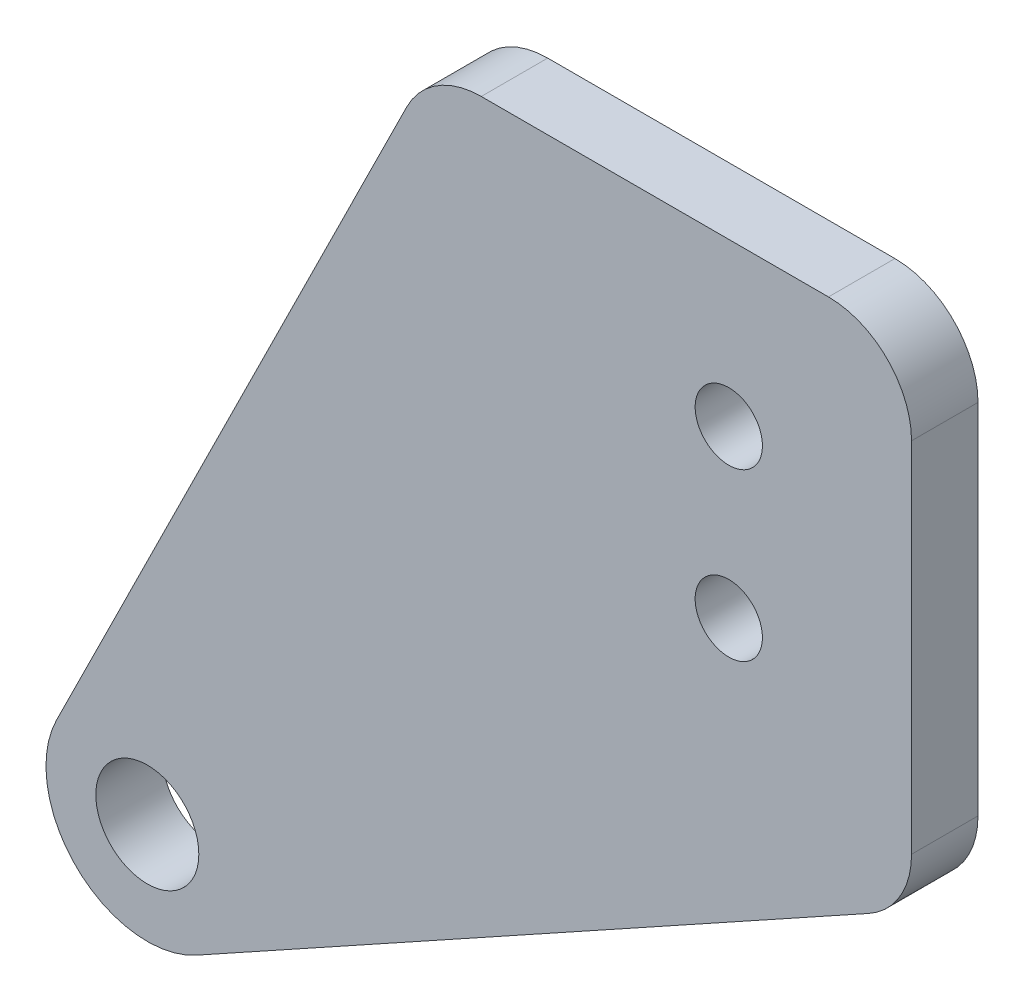
ISO-10303-21;
HEADER;
FILE_DESCRIPTION(('STEP AP214'),'2;1');
FILE_NAME('part.step','',(''),(''),'','','');
FILE_SCHEMA(('AUTOMOTIVE_DESIGN { 1 0 10303 214 1 1 1 1 }'));
ENDSEC;
DATA;
#1=APPLICATION_CONTEXT('core data for automotive mechanical design processes');
#2=APPLICATION_PROTOCOL_DEFINITION('international standard','automotive_design',2000,#1);
#3=PRODUCT_CONTEXT('',#1,'mechanical');
#4=PRODUCT('Part','Part','',(#3));
#5=PRODUCT_RELATED_PRODUCT_CATEGORY('part','',(#4));
#6=PRODUCT_DEFINITION_FORMATION('','',#4);
#7=PRODUCT_DEFINITION_CONTEXT('part definition',#1,'design');
#8=PRODUCT_DEFINITION('design','',#6,#7);
#9=PRODUCT_DEFINITION_SHAPE('','',#8);
#10=(LENGTH_UNIT() NAMED_UNIT(*) SI_UNIT(.MILLI.,.METRE.));
#11=(NAMED_UNIT(*) PLANE_ANGLE_UNIT() SI_UNIT($,.RADIAN.));
#12=(NAMED_UNIT(*) SI_UNIT($,.STERADIAN.) SOLID_ANGLE_UNIT());
#13=UNCERTAINTY_MEASURE_WITH_UNIT(LENGTH_MEASURE(1.E-05),#10,'distance_accuracy_value','');
#14=(GEOMETRIC_REPRESENTATION_CONTEXT(3) GLOBAL_UNCERTAINTY_ASSIGNED_CONTEXT((#13)) GLOBAL_UNIT_ASSIGNED_CONTEXT((#10,
#11,#12)) REPRESENTATION_CONTEXT('',''));
#15=CARTESIAN_POINT('',(0.,0.,0.));
#16=DIRECTION('',(0.,0.,1.));
#17=DIRECTION('',(1.,0.,0.));
#18=AXIS2_PLACEMENT_3D('',#15,#16,#17);
#19=CARTESIAN_POINT('',(7.89382808051515,-14.2550363224969,4.));
#20=DIRECTION('',(-0.484440231931471,0.874824360478252,0.));
#21=DIRECTION('',(-0.874824360478252,-0.484440231931471,0.));
#22=AXIS2_PLACEMENT_3D('',#19,#20,#21);
#23=PLANE('',#22);
#24=DIRECTION('',(0.874824360478252,0.484440231931471,0.));
#25=VECTOR('',#24,1.);
#26=CARTESIAN_POINT('',(7.89382808051515,-14.2550363224969,0.));
#27=LINE('',#26,#25);
#28=CARTESIAN_POINT('',(-36.044914585218,-38.5864285989173,0.));
#29=VERTEX_POINT('',#28);
#30=CARTESIAN_POINT('',(4.42220115965735,-16.1774745017452,0.));
#31=VERTEX_POINT('',#30);
#32=EDGE_CURVE('E137',#29,#31,#27,.T.);
#33=ORIENTED_EDGE('',*,*,#32,.T.);
#34=DIRECTION('',(0.,0.,-1.));
#35=VECTOR('',#34,1.);
#36=CARTESIAN_POINT('',(4.42220115965735,-16.1774745017452,4.));
#37=LINE('',#36,#35);
#38=CARTESIAN_POINT('',(4.42220115965735,-16.1774745017452,4.));
#39=VERTEX_POINT('',#38);
#40=EDGE_CURVE('E45',#31,#39,#37,.F.);
#41=ORIENTED_EDGE('',*,*,#40,.T.);
#42=DIRECTION('',(0.874824360478252,0.484440231931471,0.));
#43=VECTOR('',#42,1.);
#44=CARTESIAN_POINT('',(7.89382808051515,-14.2550363224969,4.));
#45=LINE('',#44,#43);
#46=CARTESIAN_POINT('',(-36.044914585218,-38.5864285989173,4.));
#47=VERTEX_POINT('',#46);
#48=EDGE_CURVE('E157',#47,#39,#45,.T.);
#49=ORIENTED_EDGE('',*,*,#48,.F.);
#50=DIRECTION('',(0.,0.,-1.));
#51=VECTOR('',#50,1.);
#52=CARTESIAN_POINT('',(-36.044914585218,-38.5864285989173,4.));
#53=LINE('',#52,#51);
#54=EDGE_CURVE('E121',#47,#29,#53,.T.);
#55=ORIENTED_EDGE('',*,*,#54,.T.);
#56=EDGE_LOOP('',(#33,#41,#49,#55));
#57=FACE_BOUND('',#56,.T.);
#58=ADVANCED_FACE('F37',(#57),#23,.F.);
#59=CARTESIAN_POINT('',(7.,0.,4.));
#60=DIRECTION('',(-1.,0.,0.));
#61=DIRECTION('',(0.,0.,1.));
#62=AXIS2_PLACEMENT_3D('',#59,#60,#61);
#63=PLANE('',#62);
#64=DIRECTION('',(0.,1.,0.));
#65=VECTOR('',#64,1.);
#66=CARTESIAN_POINT('',(7.,0.,0.));
#67=LINE('',#66,#65);
#68=CARTESIAN_POINT('',(7.,-11.8033526993539,0.));
#69=VERTEX_POINT('',#68);
#70=CARTESIAN_POINT('',(7.,9.75,0.));
#71=VERTEX_POINT('',#70);
#72=EDGE_CURVE('E139',#69,#71,#67,.T.);
#73=ORIENTED_EDGE('',*,*,#72,.T.);
#74=DIRECTION('',(0.,0.,-1.));
#75=VECTOR('',#74,1.);
#76=CARTESIAN_POINT('',(7.,9.75,4.));
#77=LINE('',#76,#75);
#78=CARTESIAN_POINT('',(7.,9.75,4.));
#79=VERTEX_POINT('',#78);
#80=EDGE_CURVE('E172',#71,#79,#77,.F.);
#81=ORIENTED_EDGE('',*,*,#80,.T.);
#82=DIRECTION('',(0.,1.,0.));
#83=VECTOR('',#82,1.);
#84=CARTESIAN_POINT('',(7.,0.,4.));
#85=LINE('',#84,#83);
#86=CARTESIAN_POINT('',(7.,-11.8033526993539,4.));
#87=VERTEX_POINT('',#86);
#88=EDGE_CURVE('E181',#87,#79,#85,.T.);
#89=ORIENTED_EDGE('',*,*,#88,.F.);
#90=DIRECTION('',(0.,0.,-1.));
#91=VECTOR('',#90,1.);
#92=CARTESIAN_POINT('',(7.,-11.8033526993539,4.));
#93=LINE('',#92,#91);
#94=EDGE_CURVE('E169',#87,#69,#93,.T.);
#95=ORIENTED_EDGE('',*,*,#94,.T.);
#96=EDGE_LOOP('',(#73,#81,#89,#95));
#97=FACE_BOUND('',#96,.T.);
#98=ADVANCED_FACE('F195',(#97),#63,.F.);
#99=CARTESIAN_POINT('',(0.,14.75,4.));
#100=DIRECTION('',(0.,1.,0.));
#101=DIRECTION('',(0.,0.,1.));
#102=AXIS2_PLACEMENT_3D('',#99,#100,#101);
#103=PLANE('',#102);
#104=DIRECTION('',(1.,0.,0.));
#105=VECTOR('',#104,1.);
#106=CARTESIAN_POINT('',(0.,14.75,4.));
#107=LINE('',#106,#105);
#108=CARTESIAN_POINT('',(-18.8988149973664,14.75,4.));
#109=VERTEX_POINT('',#108);
#110=CARTESIAN_POINT('',(2.,14.75,4.));
#111=VERTEX_POINT('',#110);
#112=EDGE_CURVE('E111',#109,#111,#107,.T.);
#113=ORIENTED_EDGE('',*,*,#112,.T.);
#114=DIRECTION('',(0.,0.,-1.));
#115=VECTOR('',#114,1.);
#116=CARTESIAN_POINT('',(2.,14.75,0.));
#117=LINE('',#116,#115);
#118=CARTESIAN_POINT('',(2.,14.75,0.));
#119=VERTEX_POINT('',#118);
#120=EDGE_CURVE('E160',#111,#119,#117,.T.);
#121=ORIENTED_EDGE('',*,*,#120,.T.);
#122=DIRECTION('',(1.,0.,0.));
#123=VECTOR('',#122,1.);
#124=CARTESIAN_POINT('',(0.,14.75,0.));
#125=LINE('',#124,#123);
#126=CARTESIAN_POINT('',(-18.8988149973664,14.75,0.));
#127=VERTEX_POINT('',#126);
#128=EDGE_CURVE('E142',#127,#119,#125,.T.);
#129=ORIENTED_EDGE('',*,*,#128,.F.);
#130=DIRECTION('',(0.,0.,-1.));
#131=VECTOR('',#130,1.);
#132=CARTESIAN_POINT('',(-18.8988149973664,14.75,4.));
#133=LINE('',#132,#131);
#134=EDGE_CURVE('E120',#127,#109,#133,.F.);
#135=ORIENTED_EDGE('',*,*,#134,.T.);
#136=EDGE_LOOP('',(#113,#121,#129,#135));
#137=FACE_BOUND('',#136,.T.);
#138=ADVANCED_FACE('F186',(#137),#103,.T.);
#139=CARTESIAN_POINT('',(-23.527615711847,11.6702845745402,4.));
#140=DIRECTION('',(0.895847066320016,-0.444362502655006,0.));
#141=DIRECTION('',(0.444362502655006,0.895847066320016,0.));
#142=AXIS2_PLACEMENT_3D('',#139,#140,#141);
#143=PLANE('',#142);
#144=DIRECTION('',(-0.444362502655006,-0.895847066320016,0.));
#145=VECTOR('',#144,1.);
#146=CARTESIAN_POINT('',(-23.527615711847,11.6702845745402,4.));
#147=LINE('',#146,#145);
#148=CARTESIAN_POINT('',(-23.3780503289665,11.971812513275,4.));
#149=VERTEX_POINT('',#148);
#150=CARTESIAN_POINT('',(-44.4646671045521,-30.5393887338045,4.));
#151=VERTEX_POINT('',#150);
#152=EDGE_CURVE('E101',#149,#151,#147,.T.);
#153=ORIENTED_EDGE('',*,*,#152,.F.);
#154=DIRECTION('',(0.,0.,-1.));
#155=VECTOR('',#154,1.);
#156=CARTESIAN_POINT('',(-23.3780503289665,11.971812513275,0.));
#157=LINE('',#156,#155);
#158=CARTESIAN_POINT('',(-23.3780503289665,11.971812513275,0.));
#159=VERTEX_POINT('',#158);
#160=EDGE_CURVE('E11',#149,#159,#157,.T.);
#161=ORIENTED_EDGE('',*,*,#160,.T.);
#162=DIRECTION('',(-0.444362502655006,-0.895847066320016,0.));
#163=VECTOR('',#162,1.);
#164=CARTESIAN_POINT('',(-23.527615711847,11.6702845745402,0.));
#165=LINE('',#164,#163);
#166=CARTESIAN_POINT('',(-44.4646671045521,-30.5393887338045,0.));
#167=VERTEX_POINT('',#166);
#168=EDGE_CURVE('E117',#159,#167,#165,.T.);
#169=ORIENTED_EDGE('',*,*,#168,.T.);
#170=DIRECTION('',(0.,0.,-1.));
#171=VECTOR('',#170,1.);
#172=CARTESIAN_POINT('',(-44.4646671045521,-30.5393887338045,4.));
#173=LINE('',#172,#171);
#174=EDGE_CURVE('E114',#151,#167,#173,.T.);
#175=ORIENTED_EDGE('',*,*,#174,.F.);
#176=EDGE_LOOP('',(#153,#161,#169,#175));
#177=FACE_BOUND('',#176,.T.);
#178=ADVANCED_FACE('F115',(#177),#143,.F.);
#179=CARTESIAN_POINT('',(-4.00000000000001,5.,4.));
#180=DIRECTION('',(0.,0.,-1.));
#181=DIRECTION('',(-1.,0.,0.));
#182=AXIS2_PLACEMENT_3D('',#179,#180,#181);
#183=CYLINDRICAL_SURFACE('',#182,2.025);
#184=CARTESIAN_POINT('',(-4.00000000000001,5.,4.));
#185=DIRECTION('',(0.,0.,1.));
#186=DIRECTION('',(1.,0.,0.));
#187=AXIS2_PLACEMENT_3D('',#184,#185,#186);
#188=CIRCLE('',#187,2.025);
#189=CARTESIAN_POINT('',(-1.97500000000001,5.,4.));
#190=VERTEX_POINT('',#189);
#191=EDGE_CURVE('E128',#190,#190,#188,.T.);
#192=ORIENTED_EDGE('',*,*,#191,.T.);
#193=EDGE_LOOP('',(#192));
#194=FACE_BOUND('',#193,.T.);
#195=CARTESIAN_POINT('',(-4.00000000000001,5.,0.));
#196=DIRECTION('',(0.,0.,1.));
#197=DIRECTION('',(1.,0.,0.));
#198=AXIS2_PLACEMENT_3D('',#195,#196,#197);
#199=CIRCLE('',#198,2.025);
#200=CARTESIAN_POINT('',(-1.97500000000001,5.,0.));
#201=VERTEX_POINT('',#200);
#202=EDGE_CURVE('E151',#201,#201,#199,.T.);
#203=ORIENTED_EDGE('',*,*,#202,.F.);
#204=EDGE_LOOP('',(#203));
#205=FACE_BOUND('',#204,.T.);
#206=ADVANCED_FACE('F258',(#194,#205),#183,.F.);
#207=CARTESIAN_POINT('',(-4.,-5.,4.));
#208=DIRECTION('',(0.,0.,-1.));
#209=DIRECTION('',(-1.,0.,0.));
#210=AXIS2_PLACEMENT_3D('',#207,#208,#209);
#211=CYLINDRICAL_SURFACE('',#210,2.025);
#212=CARTESIAN_POINT('',(-4.,-5.,4.));
#213=DIRECTION('',(0.,0.,1.));
#214=DIRECTION('',(1.,0.,0.));
#215=AXIS2_PLACEMENT_3D('',#212,#213,#214);
#216=CIRCLE('',#215,2.025);
#217=CARTESIAN_POINT('',(-1.975,-5.,4.));
#218=VERTEX_POINT('',#217);
#219=EDGE_CURVE('E125',#218,#218,#216,.T.);
#220=ORIENTED_EDGE('',*,*,#219,.T.);
#221=EDGE_LOOP('',(#220));
#222=FACE_BOUND('',#221,.T.);
#223=CARTESIAN_POINT('',(-4.,-5.,0.));
#224=DIRECTION('',(0.,0.,1.));
#225=DIRECTION('',(1.,0.,0.));
#226=AXIS2_PLACEMENT_3D('',#223,#224,#225);
#227=CIRCLE('',#226,2.025);
#228=CARTESIAN_POINT('',(-1.975,-5.,0.));
#229=VERTEX_POINT('',#228);
#230=EDGE_CURVE('E148',#229,#229,#227,.T.);
#231=ORIENTED_EDGE('',*,*,#230,.F.);
#232=EDGE_LOOP('',(#231));
#233=FACE_BOUND('',#232,.T.);
#234=ADVANCED_FACE('F294',(#222,#233),#211,.F.);
#235=CARTESIAN_POINT('',(-39.,-33.25,4.));
#236=DIRECTION('',(0.,0.,-1.));
#237=DIRECTION('',(-1.,0.,0.));
#238=AXIS2_PLACEMENT_3D('',#235,#236,#237);
#239=CYLINDRICAL_SURFACE('',#238,6.1);
#240=CARTESIAN_POINT('',(-39.,-33.25,0.));
#241=DIRECTION('',(0.,0.,1.));
#242=DIRECTION('',(1.,0.,0.));
#243=AXIS2_PLACEMENT_3D('',#240,#241,#242);
#244=CIRCLE('',#243,6.1);
#245=EDGE_CURVE('E146',#167,#29,#244,.T.);
#246=ORIENTED_EDGE('',*,*,#245,.T.);
#247=ORIENTED_EDGE('',*,*,#54,.F.);
#248=CARTESIAN_POINT('',(-39.,-33.25,4.));
#249=DIRECTION('',(0.,0.,1.));
#250=DIRECTION('',(1.,0.,0.));
#251=AXIS2_PLACEMENT_3D('',#248,#249,#250);
#252=CIRCLE('',#251,6.1);
#253=EDGE_CURVE('E107',#151,#47,#252,.T.);
#254=ORIENTED_EDGE('',*,*,#253,.F.);
#255=ORIENTED_EDGE('',*,*,#174,.T.);
#256=EDGE_LOOP('',(#246,#247,#254,#255));
#257=FACE_BOUND('',#256,.T.);
#258=ADVANCED_FACE('F123',(#257),#239,.T.);
#259=CARTESIAN_POINT('',(-39.,-33.25,4.));
#260=DIRECTION('',(0.,0.,-1.));
#261=DIRECTION('',(-1.,0.,0.));
#262=AXIS2_PLACEMENT_3D('',#259,#260,#261);
#263=CYLINDRICAL_SURFACE('',#262,3.09999999999999);
#264=CARTESIAN_POINT('',(-39.,-33.25,4.));
#265=DIRECTION('',(0.,0.,1.));
#266=DIRECTION('',(1.,0.,0.));
#267=AXIS2_PLACEMENT_3D('',#264,#265,#266);
#268=CIRCLE('',#267,3.09999999999999);
#269=CARTESIAN_POINT('',(-35.9,-33.25,4.));
#270=VERTEX_POINT('',#269);
#271=EDGE_CURVE('E134',#270,#270,#268,.T.);
#272=ORIENTED_EDGE('',*,*,#271,.T.);
#273=EDGE_LOOP('',(#272));
#274=FACE_BOUND('',#273,.T.);
#275=CARTESIAN_POINT('',(-39.,-33.25,0.));
#276=DIRECTION('',(0.,0.,1.));
#277=DIRECTION('',(1.,0.,0.));
#278=AXIS2_PLACEMENT_3D('',#275,#276,#277);
#279=CIRCLE('',#278,3.09999999999999);
#280=CARTESIAN_POINT('',(-35.9,-33.25,0.));
#281=VERTEX_POINT('',#280);
#282=EDGE_CURVE('E154',#281,#281,#279,.T.);
#283=ORIENTED_EDGE('',*,*,#282,.F.);
#284=EDGE_LOOP('',(#283));
#285=FACE_BOUND('',#284,.T.);
#286=ADVANCED_FACE('F247',(#274,#285),#263,.F.);
#287=CARTESIAN_POINT('',(0.,0.,4.));
#288=DIRECTION('',(0.,0.,1.));
#289=DIRECTION('',(1.,0.,0.));
#290=AXIS2_PLACEMENT_3D('',#287,#288,#289);
#291=PLANE('',#290);
#292=ORIENTED_EDGE('',*,*,#88,.T.);
#293=CARTESIAN_POINT('',(2.,9.75,4.));
#294=DIRECTION('',(0.,0.,1.));
#295=DIRECTION('',(1.,0.,0.));
#296=AXIS2_PLACEMENT_3D('',#293,#294,#295);
#297=CIRCLE('',#296,5.);
#298=EDGE_CURVE('E177',#79,#111,#297,.T.);
#299=ORIENTED_EDGE('',*,*,#298,.T.);
#300=ORIENTED_EDGE('',*,*,#112,.F.);
#301=CARTESIAN_POINT('',(-18.8988149973664,9.75,4.));
#302=DIRECTION('',(0.,0.,1.));
#303=DIRECTION('',(1.,0.,0.));
#304=AXIS2_PLACEMENT_3D('',#301,#302,#303);
#305=CIRCLE('',#304,5.);
#306=EDGE_CURVE('E52',#109,#149,#305,.T.);
#307=ORIENTED_EDGE('',*,*,#306,.T.);
#308=ORIENTED_EDGE('',*,*,#152,.T.);
#309=ORIENTED_EDGE('',*,*,#253,.T.);
#310=ORIENTED_EDGE('',*,*,#48,.T.);
#311=CARTESIAN_POINT('',(2.,-11.8033526993539,4.));
#312=DIRECTION('',(0.,0.,1.));
#313=DIRECTION('',(1.,0.,0.));
#314=AXIS2_PLACEMENT_3D('',#311,#312,#313);
#315=CIRCLE('',#314,5.);
#316=EDGE_CURVE('E175',#39,#87,#315,.T.);
#317=ORIENTED_EDGE('',*,*,#316,.T.);
#318=EDGE_LOOP('',(#292,#299,#300,#307,#308,#309,#310,#317));
#319=FACE_BOUND('',#318,.T.);
#320=ORIENTED_EDGE('',*,*,#219,.F.);
#321=EDGE_LOOP('',(#320));
#322=FACE_BOUND('',#321,.T.);
#323=ORIENTED_EDGE('',*,*,#191,.F.);
#324=EDGE_LOOP('',(#323));
#325=FACE_BOUND('',#324,.T.);
#326=ORIENTED_EDGE('',*,*,#271,.F.);
#327=EDGE_LOOP('',(#326));
#328=FACE_BOUND('',#327,.T.);
#329=ADVANCED_FACE('F104',(#319,#322,#325,#328),#291,.T.);
#330=CARTESIAN_POINT('',(0.,0.,0.));
#331=DIRECTION('',(0.,0.,1.));
#332=DIRECTION('',(1.,0.,0.));
#333=AXIS2_PLACEMENT_3D('',#330,#331,#332);
#334=PLANE('',#333);
#335=ORIENTED_EDGE('',*,*,#128,.T.);
#336=CARTESIAN_POINT('',(2.,9.75,0.));
#337=DIRECTION('',(0.,0.,1.));
#338=DIRECTION('',(1.,0.,0.));
#339=AXIS2_PLACEMENT_3D('',#336,#337,#338);
#340=CIRCLE('',#339,5.);
#341=EDGE_CURVE('E167',#119,#71,#340,.F.);
#342=ORIENTED_EDGE('',*,*,#341,.T.);
#343=ORIENTED_EDGE('',*,*,#72,.F.);
#344=CARTESIAN_POINT('',(2.,-11.8033526993539,0.));
#345=DIRECTION('',(0.,0.,1.));
#346=DIRECTION('',(1.,0.,0.));
#347=AXIS2_PLACEMENT_3D('',#344,#345,#346);
#348=CIRCLE('',#347,5.);
#349=EDGE_CURVE('E165',#69,#31,#348,.F.);
#350=ORIENTED_EDGE('',*,*,#349,.T.);
#351=ORIENTED_EDGE('',*,*,#32,.F.);
#352=ORIENTED_EDGE('',*,*,#245,.F.);
#353=ORIENTED_EDGE('',*,*,#168,.F.);
#354=CARTESIAN_POINT('',(-18.8988149973664,9.75,0.));
#355=DIRECTION('',(0.,0.,1.));
#356=DIRECTION('',(1.,0.,0.));
#357=AXIS2_PLACEMENT_3D('',#354,#355,#356);
#358=CIRCLE('',#357,5.);
#359=EDGE_CURVE('E163',#159,#127,#358,.F.);
#360=ORIENTED_EDGE('',*,*,#359,.T.);
#361=EDGE_LOOP('',(#335,#342,#343,#350,#351,#352,#353,#360));
#362=FACE_BOUND('',#361,.T.);
#363=ORIENTED_EDGE('',*,*,#230,.T.);
#364=EDGE_LOOP('',(#363));
#365=FACE_BOUND('',#364,.T.);
#366=ORIENTED_EDGE('',*,*,#202,.T.);
#367=EDGE_LOOP('',(#366));
#368=FACE_BOUND('',#367,.T.);
#369=ORIENTED_EDGE('',*,*,#282,.T.);
#370=EDGE_LOOP('',(#369));
#371=FACE_BOUND('',#370,.T.);
#372=ADVANCED_FACE('F192',(#362,#365,#368,#371),#334,.F.);
#373=CARTESIAN_POINT('',(2.,9.75,4.));
#374=DIRECTION('',(0.,0.,1.));
#375=DIRECTION('',(1.,0.,0.));
#376=AXIS2_PLACEMENT_3D('',#373,#374,#375);
#377=CYLINDRICAL_SURFACE('',#376,5.);
#378=ORIENTED_EDGE('',*,*,#298,.F.);
#379=ORIENTED_EDGE('',*,*,#80,.F.);
#380=ORIENTED_EDGE('',*,*,#341,.F.);
#381=ORIENTED_EDGE('',*,*,#120,.F.);
#382=EDGE_LOOP('',(#378,#379,#380,#381));
#383=FACE_BOUND('',#382,.T.);
#384=ADVANCED_FACE('F189',(#383),#377,.T.);
#385=CARTESIAN_POINT('',(2.,-11.8033526993539,4.));
#386=DIRECTION('',(0.,0.,-1.));
#387=DIRECTION('',(-1.,0.,0.));
#388=AXIS2_PLACEMENT_3D('',#385,#386,#387);
#389=CYLINDRICAL_SURFACE('',#388,5.);
#390=ORIENTED_EDGE('',*,*,#316,.F.);
#391=ORIENTED_EDGE('',*,*,#40,.F.);
#392=ORIENTED_EDGE('',*,*,#349,.F.);
#393=ORIENTED_EDGE('',*,*,#94,.F.);
#394=EDGE_LOOP('',(#390,#391,#392,#393));
#395=FACE_BOUND('',#394,.T.);
#396=ADVANCED_FACE('F199',(#395),#389,.T.);
#397=CARTESIAN_POINT('',(-18.8988149973664,9.75,4.));
#398=DIRECTION('',(0.,0.,1.));
#399=DIRECTION('',(1.,0.,0.));
#400=AXIS2_PLACEMENT_3D('',#397,#398,#399);
#401=CYLINDRICAL_SURFACE('',#400,5.);
#402=ORIENTED_EDGE('',*,*,#306,.F.);
#403=ORIENTED_EDGE('',*,*,#134,.F.);
#404=ORIENTED_EDGE('',*,*,#359,.F.);
#405=ORIENTED_EDGE('',*,*,#160,.F.);
#406=EDGE_LOOP('',(#402,#403,#404,#405));
#407=FACE_BOUND('',#406,.T.);
#408=ADVANCED_FACE('F39',(#407),#401,.T.);
#409=CLOSED_SHELL('',(#58,#98,#138,#178,#206,#234,#258,#286,#329,#372,#384,#396,#408));
#410=MANIFOLD_SOLID_BREP('B2',#409);
#411=ADVANCED_BREP_SHAPE_REPRESENTATION('',(#18,#410),#14);
#412=SHAPE_DEFINITION_REPRESENTATION(#9,#411);
ENDSEC;
END-ISO-10303-21;
